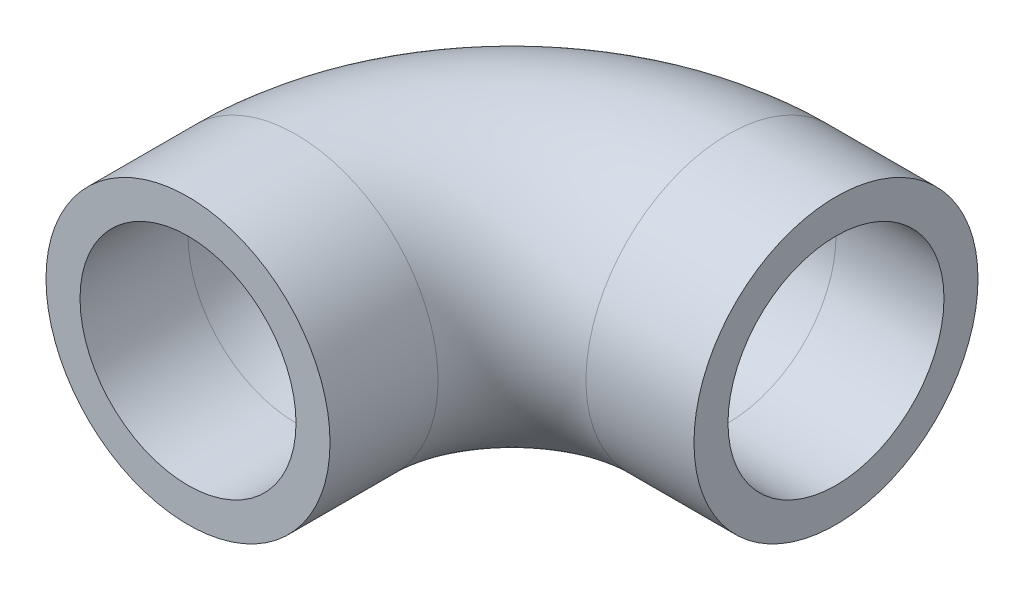
ISO-10303-21;
HEADER;
FILE_DESCRIPTION(('STEP AP214'),'2;1');
FILE_NAME('part.step','',(''),(''),'','','');
FILE_SCHEMA(('AUTOMOTIVE_DESIGN { 1 0 10303 214 1 1 1 1 }'));
ENDSEC;
DATA;
#1=APPLICATION_CONTEXT('core data for automotive mechanical design processes');
#2=APPLICATION_PROTOCOL_DEFINITION('international standard','automotive_design',2000,#1);
#3=PRODUCT_CONTEXT('',#1,'mechanical');
#4=PRODUCT('Part','Part','',(#3));
#5=PRODUCT_RELATED_PRODUCT_CATEGORY('part','',(#4));
#6=PRODUCT_DEFINITION_FORMATION('','',#4);
#7=PRODUCT_DEFINITION_CONTEXT('part definition',#1,'design');
#8=PRODUCT_DEFINITION('design','',#6,#7);
#9=PRODUCT_DEFINITION_SHAPE('','',#8);
#10=(LENGTH_UNIT() NAMED_UNIT(*) SI_UNIT(.MILLI.,.METRE.));
#11=(NAMED_UNIT(*) PLANE_ANGLE_UNIT() SI_UNIT($,.RADIAN.));
#12=(NAMED_UNIT(*) SI_UNIT($,.STERADIAN.) SOLID_ANGLE_UNIT());
#13=UNCERTAINTY_MEASURE_WITH_UNIT(LENGTH_MEASURE(1.E-05),#10,'distance_accuracy_value','');
#14=(GEOMETRIC_REPRESENTATION_CONTEXT(3) GLOBAL_UNCERTAINTY_ASSIGNED_CONTEXT((#13)) GLOBAL_UNIT_ASSIGNED_CONTEXT((#10,
#11,#12)) REPRESENTATION_CONTEXT('',''));
#15=CARTESIAN_POINT('',(0.,0.,0.));
#16=DIRECTION('',(0.,0.,1.));
#17=DIRECTION('',(1.,0.,0.));
#18=AXIS2_PLACEMENT_3D('',#15,#16,#17);
#19=CARTESIAN_POINT('',(0.,0.,0.));
#20=DIRECTION('',(0.,0.,-1.));
#21=DIRECTION('',(-1.,0.,0.));
#22=AXIS2_PLACEMENT_3D('',#19,#20,#21);
#23=CYLINDRICAL_SURFACE('',#22,16.7005);
#24=CARTESIAN_POINT('',(0.,0.,-12.7));
#25=DIRECTION('',(0.,0.,1.));
#26=DIRECTION('',(1.,0.,0.));
#27=AXIS2_PLACEMENT_3D('',#24,#25,#26);
#28=CIRCLE('',#27,16.7005);
#29=CARTESIAN_POINT('',(-16.7005,0.,-12.7));
#30=VERTEX_POINT('',#29);
#31=EDGE_CURVE('E99',#30,#30,#28,.T.);
#32=ORIENTED_EDGE('',*,*,#31,.T.);
#33=EDGE_LOOP('',(#32));
#34=FACE_BOUND('',#33,.T.);
#35=CARTESIAN_POINT('',(0.,0.,0.));
#36=DIRECTION('',(0.,0.,1.));
#37=DIRECTION('',(1.,0.,0.));
#38=AXIS2_PLACEMENT_3D('',#35,#36,#37);
#39=CIRCLE('',#38,16.7005);
#40=CARTESIAN_POINT('',(16.7005,0.,0.));
#41=VERTEX_POINT('',#40);
#42=EDGE_CURVE('E48',#41,#41,#39,.T.);
#43=ORIENTED_EDGE('',*,*,#42,.F.);
#44=EDGE_LOOP('',(#43));
#45=FACE_BOUND('',#44,.T.);
#46=ADVANCED_FACE('F33',(#34,#45),#23,.T.);
#47=CARTESIAN_POINT('',(25.4,0.,-12.7));
#48=DIRECTION('',(0.,-1.,0.));
#49=DIRECTION('',(0.,0.,-1.));
#50=AXIS2_PLACEMENT_3D('',#47,#48,#49);
#51=TOROIDAL_SURFACE('',#50,25.4,16.7005);
#52=CARTESIAN_POINT('',(25.4,0.,-38.1));
#53=DIRECTION('',(-1.,0.,0.));
#54=DIRECTION('',(0.,0.,1.));
#55=AXIS2_PLACEMENT_3D('',#52,#53,#54);
#56=CIRCLE('',#55,16.7005);
#57=CARTESIAN_POINT('',(25.4,0.,-54.8005));
#58=VERTEX_POINT('',#57);
#59=EDGE_CURVE('E37',#58,#58,#56,.T.);
#60=CARTESIAN_POINT('',(25.4,0.,-12.7));
#61=DIRECTION('',(0.,-1.,0.));
#62=DIRECTION('',(0.,0.,-1.));
#63=AXIS2_PLACEMENT_3D('',#60,#61,#62);
#64=CIRCLE('',#63,42.1005);
#65=EDGE_CURVE('',#30,#58,#64,.T.);
#66=ORIENTED_EDGE('',*,*,#31,.F.);
#67=ORIENTED_EDGE('',*,*,#59,.T.);
#68=ORIENTED_EDGE('',*,*,#65,.T.);
#69=ORIENTED_EDGE('',*,*,#65,.F.);
#70=EDGE_LOOP('',(#66,#68,#67,#69));
#71=FACE_BOUND('',#70,.T.);
#72=ADVANCED_FACE('F106',(#71),#51,.T.);
#73=CARTESIAN_POINT('',(25.4,0.,-38.1));
#74=DIRECTION('',(1.,0.,0.));
#75=DIRECTION('',(0.,0.,-1.));
#76=AXIS2_PLACEMENT_3D('',#73,#74,#75);
#77=CYLINDRICAL_SURFACE('',#76,16.7005);
#78=CARTESIAN_POINT('',(38.1,0.,-38.1));
#79=DIRECTION('',(-1.,0.,0.));
#80=DIRECTION('',(0.,0.,1.));
#81=AXIS2_PLACEMENT_3D('',#78,#79,#80);
#82=CIRCLE('',#81,16.7005);
#83=CARTESIAN_POINT('',(38.1,0.,-21.3995));
#84=VERTEX_POINT('',#83);
#85=EDGE_CURVE('E53',#84,#84,#82,.T.);
#86=ORIENTED_EDGE('',*,*,#85,.T.);
#87=EDGE_LOOP('',(#86));
#88=FACE_BOUND('',#87,.T.);
#89=ORIENTED_EDGE('',*,*,#59,.F.);
#90=EDGE_LOOP('',(#89));
#91=FACE_BOUND('',#90,.T.);
#92=ADVANCED_FACE('F35',(#88,#91),#77,.T.);
#93=CARTESIAN_POINT('',(0.,0.,0.));
#94=DIRECTION('',(0.,0.,1.));
#95=DIRECTION('',(1.,0.,0.));
#96=AXIS2_PLACEMENT_3D('',#93,#94,#95);
#97=PLANE('',#96);
#98=CARTESIAN_POINT('',(0.,0.,0.));
#99=DIRECTION('',(0.,0.,1.));
#100=DIRECTION('',(1.,0.,0.));
#101=AXIS2_PLACEMENT_3D('',#98,#99,#100);
#102=CIRCLE('',#101,12.7);
#103=CARTESIAN_POINT('',(12.7,0.,0.));
#104=VERTEX_POINT('',#103);
#105=EDGE_CURVE('E92',#104,#104,#102,.F.);
#106=ORIENTED_EDGE('',*,*,#105,.T.);
#107=EDGE_LOOP('',(#106));
#108=FACE_BOUND('',#107,.T.);
#109=ORIENTED_EDGE('',*,*,#42,.T.);
#110=EDGE_LOOP('',(#109));
#111=FACE_BOUND('',#110,.T.);
#112=ADVANCED_FACE('F66',(#108,#111),#97,.T.);
#113=CARTESIAN_POINT('',(38.1,0.,-38.1));
#114=DIRECTION('',(-1.,0.,0.));
#115=DIRECTION('',(0.,0.,1.));
#116=AXIS2_PLACEMENT_3D('',#113,#114,#115);
#117=PLANE('',#116);
#118=CARTESIAN_POINT('',(38.1,0.,-38.1));
#119=DIRECTION('',(-1.,0.,0.));
#120=DIRECTION('',(0.,0.,1.));
#121=AXIS2_PLACEMENT_3D('',#118,#119,#120);
#122=CIRCLE('',#121,12.7);
#123=CARTESIAN_POINT('',(38.1,0.,-25.4));
#124=VERTEX_POINT('',#123);
#125=EDGE_CURVE('E11',#124,#124,#122,.F.);
#126=ORIENTED_EDGE('',*,*,#125,.F.);
#127=EDGE_LOOP('',(#126));
#128=FACE_BOUND('',#127,.T.);
#129=ORIENTED_EDGE('',*,*,#85,.F.);
#130=EDGE_LOOP('',(#129));
#131=FACE_BOUND('',#130,.T.);
#132=ADVANCED_FACE('F63',(#128,#131),#117,.F.);
#133=CARTESIAN_POINT('',(0.,0.,0.));
#134=DIRECTION('',(0.,0.,-1.));
#135=DIRECTION('',(-1.,0.,0.));
#136=AXIS2_PLACEMENT_3D('',#133,#134,#135);
#137=CYLINDRICAL_SURFACE('',#136,12.7);
#138=CARTESIAN_POINT('',(0.,0.,-12.7));
#139=DIRECTION('',(0.,0.,1.));
#140=DIRECTION('',(1.,0.,0.));
#141=AXIS2_PLACEMENT_3D('',#138,#139,#140);
#142=CIRCLE('',#141,12.7);
#143=CARTESIAN_POINT('',(-12.7,0.,-12.7));
#144=VERTEX_POINT('',#143);
#145=EDGE_CURVE('E91',#144,#144,#142,.F.);
#146=ORIENTED_EDGE('',*,*,#145,.T.);
#147=EDGE_LOOP('',(#146));
#148=FACE_BOUND('',#147,.T.);
#149=ORIENTED_EDGE('',*,*,#105,.F.);
#150=EDGE_LOOP('',(#149));
#151=FACE_BOUND('',#150,.T.);
#152=ADVANCED_FACE('F65',(#148,#151),#137,.F.);
#153=CARTESIAN_POINT('',(25.4,0.,-12.7));
#154=DIRECTION('',(0.,-1.,0.));
#155=DIRECTION('',(0.,0.,-1.));
#156=AXIS2_PLACEMENT_3D('',#153,#154,#155);
#157=TOROIDAL_SURFACE('',#156,25.4,12.7);
#158=CARTESIAN_POINT('',(25.4,0.,-38.1));
#159=DIRECTION('',(-1.,0.,0.));
#160=DIRECTION('',(0.,0.,1.));
#161=AXIS2_PLACEMENT_3D('',#158,#159,#160);
#162=CIRCLE('',#161,12.7);
#163=CARTESIAN_POINT('',(25.4,0.,-50.8));
#164=VERTEX_POINT('',#163);
#165=EDGE_CURVE('E42',#164,#164,#162,.F.);
#166=CARTESIAN_POINT('',(25.4,0.,-12.7));
#167=DIRECTION('',(0.,-1.,0.));
#168=DIRECTION('',(0.,0.,-1.));
#169=AXIS2_PLACEMENT_3D('',#166,#167,#168);
#170=CIRCLE('',#169,38.1);
#171=EDGE_CURVE('',#144,#164,#170,.T.);
#172=ORIENTED_EDGE('',*,*,#145,.F.);
#173=ORIENTED_EDGE('',*,*,#165,.T.);
#174=ORIENTED_EDGE('',*,*,#171,.T.);
#175=ORIENTED_EDGE('',*,*,#171,.F.);
#176=EDGE_LOOP('',(#172,#174,#173,#175));
#177=FACE_BOUND('',#176,.T.);
#178=ADVANCED_FACE('F72',(#177),#157,.F.);
#179=CARTESIAN_POINT('',(25.4,0.,-38.1));
#180=DIRECTION('',(1.,0.,0.));
#181=DIRECTION('',(0.,0.,-1.));
#182=AXIS2_PLACEMENT_3D('',#179,#180,#181);
#183=CYLINDRICAL_SURFACE('',#182,12.7);
#184=ORIENTED_EDGE('',*,*,#125,.T.);
#185=EDGE_LOOP('',(#184));
#186=FACE_BOUND('',#185,.T.);
#187=ORIENTED_EDGE('',*,*,#165,.F.);
#188=EDGE_LOOP('',(#187));
#189=FACE_BOUND('',#188,.T.);
#190=ADVANCED_FACE('F60',(#186,#189),#183,.F.);
#191=CLOSED_SHELL('',(#46,#72,#92,#112,#132,#152,#178,#190));
#192=MANIFOLD_SOLID_BREP('B2',#191);
#193=ADVANCED_BREP_SHAPE_REPRESENTATION('',(#18,#192),#14);
#194=SHAPE_DEFINITION_REPRESENTATION(#9,#193);
ENDSEC;
END-ISO-10303-21;
